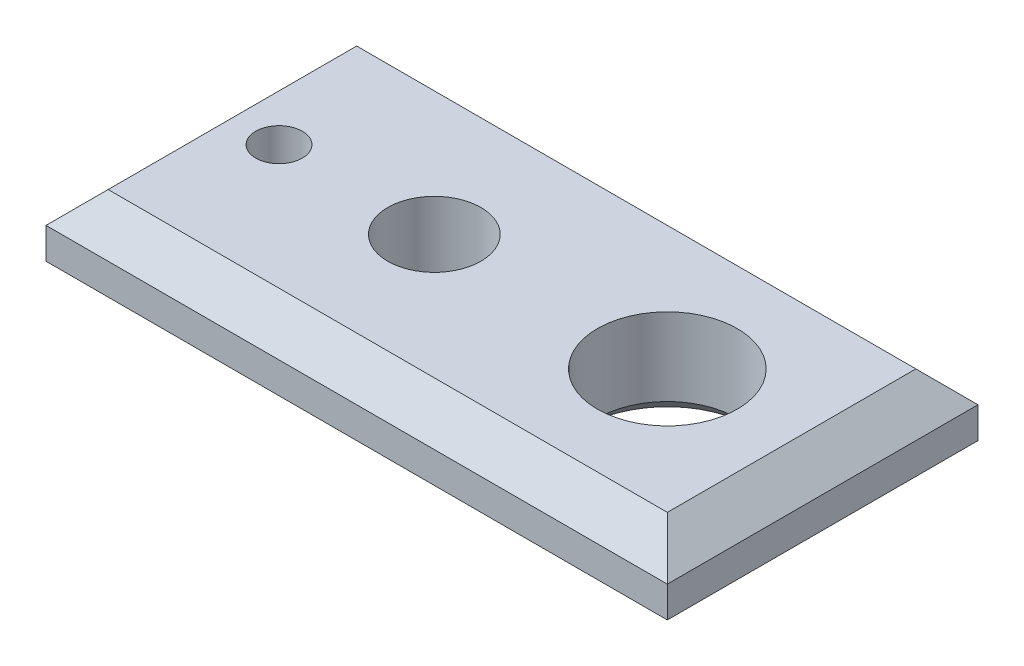
ISO-10303-21;
HEADER;
FILE_DESCRIPTION(('STEP AP214'),'2;1');
FILE_NAME('part.step','',(''),(''),'','','');
FILE_SCHEMA(('AUTOMOTIVE_DESIGN { 1 0 10303 214 1 1 1 1 }'));
ENDSEC;
DATA;
#1=APPLICATION_CONTEXT('core data for automotive mechanical design processes');
#2=APPLICATION_PROTOCOL_DEFINITION('international standard','automotive_design',2000,#1);
#3=PRODUCT_CONTEXT('',#1,'mechanical');
#4=PRODUCT('Part','Part','',(#3));
#5=PRODUCT_RELATED_PRODUCT_CATEGORY('part','',(#4));
#6=PRODUCT_DEFINITION_FORMATION('','',#4);
#7=PRODUCT_DEFINITION_CONTEXT('part definition',#1,'design');
#8=PRODUCT_DEFINITION('design','',#6,#7);
#9=PRODUCT_DEFINITION_SHAPE('','',#8);
#10=(LENGTH_UNIT() NAMED_UNIT(*) SI_UNIT(.MILLI.,.METRE.));
#11=(NAMED_UNIT(*) PLANE_ANGLE_UNIT() SI_UNIT($,.RADIAN.));
#12=(NAMED_UNIT(*) SI_UNIT($,.STERADIAN.) SOLID_ANGLE_UNIT());
#13=UNCERTAINTY_MEASURE_WITH_UNIT(LENGTH_MEASURE(1.E-05),#10,'distance_accuracy_value','');
#14=(GEOMETRIC_REPRESENTATION_CONTEXT(3) GLOBAL_UNCERTAINTY_ASSIGNED_CONTEXT((#13)) GLOBAL_UNIT_ASSIGNED_CONTEXT((#10,
#11,#12)) REPRESENTATION_CONTEXT('',''));
#15=CARTESIAN_POINT('',(0.,0.,0.));
#16=DIRECTION('',(0.,0.,1.));
#17=DIRECTION('',(1.,0.,0.));
#18=AXIS2_PLACEMENT_3D('',#15,#16,#17);
#19=CARTESIAN_POINT('',(0.,30.,0.));
#20=DIRECTION('',(0.,1.,0.));
#21=DIRECTION('',(0.,0.,1.));
#22=AXIS2_PLACEMENT_3D('',#19,#20,#21);
#23=PLANE('',#22);
#24=DIRECTION('',(0.,0.,-1.));
#25=VECTOR('',#24,1.);
#26=CARTESIAN_POINT('',(90.,30.,-50.));
#27=LINE('',#26,#25);
#28=CARTESIAN_POINT('',(90.,30.,40.));
#29=VERTEX_POINT('',#28);
#30=CARTESIAN_POINT('',(90.,30.,-40.));
#31=VERTEX_POINT('',#30);
#32=EDGE_CURVE('E114',#29,#31,#27,.T.);
#33=ORIENTED_EDGE('',*,*,#32,.T.);
#34=DIRECTION('',(-1.,0.,0.));
#35=VECTOR('',#34,1.);
#36=CARTESIAN_POINT('',(-100.,30.,-40.));
#37=LINE('',#36,#35);
#38=CARTESIAN_POINT('',(-90.,30.,-40.));
#39=VERTEX_POINT('',#38);
#40=EDGE_CURVE('E147',#31,#39,#37,.T.);
#41=ORIENTED_EDGE('',*,*,#40,.T.);
#42=DIRECTION('',(0.,0.,1.));
#43=VECTOR('',#42,1.);
#44=CARTESIAN_POINT('',(-90.,30.,50.));
#45=LINE('',#44,#43);
#46=CARTESIAN_POINT('',(-90.,30.,40.));
#47=VERTEX_POINT('',#46);
#48=EDGE_CURVE('E117',#39,#47,#45,.T.);
#49=ORIENTED_EDGE('',*,*,#48,.T.);
#50=DIRECTION('',(1.,0.,0.));
#51=VECTOR('',#50,1.);
#52=CARTESIAN_POINT('',(100.,30.,40.));
#53=LINE('',#52,#51);
#54=EDGE_CURVE('E109',#47,#29,#53,.T.);
#55=ORIENTED_EDGE('',*,*,#54,.T.);
#56=EDGE_LOOP('',(#33,#41,#49,#55));
#57=FACE_BOUND('',#56,.T.);
#58=CARTESIAN_POINT('',(-75.,30.,0.));
#59=DIRECTION('',(0.,1.,0.));
#60=DIRECTION('',(0.,0.,1.));
#61=AXIS2_PLACEMENT_3D('',#58,#59,#60);
#62=CIRCLE('',#61,7.50000000000001);
#63=CARTESIAN_POINT('',(-75.,30.,7.50000000000001));
#64=VERTEX_POINT('',#63);
#65=EDGE_CURVE('E263',#64,#64,#62,.T.);
#66=ORIENTED_EDGE('',*,*,#65,.F.);
#67=EDGE_LOOP('',(#66));
#68=FACE_BOUND('',#67,.T.);
#69=CARTESIAN_POINT('',(-25.,30.,0.));
#70=DIRECTION('',(0.,1.,0.));
#71=DIRECTION('',(0.,0.,1.));
#72=AXIS2_PLACEMENT_3D('',#69,#70,#71);
#73=CIRCLE('',#72,15.);
#74=CARTESIAN_POINT('',(-25.,30.,15.));
#75=VERTEX_POINT('',#74);
#76=EDGE_CURVE('E259',#75,#75,#73,.T.);
#77=ORIENTED_EDGE('',*,*,#76,.F.);
#78=EDGE_LOOP('',(#77));
#79=FACE_BOUND('',#78,.T.);
#80=CARTESIAN_POINT('',(50.,30.,0.));
#81=DIRECTION('',(0.,1.,0.));
#82=DIRECTION('',(0.,0.,1.));
#83=AXIS2_PLACEMENT_3D('',#80,#81,#82);
#84=CIRCLE('',#83,22.5);
#85=CARTESIAN_POINT('',(50.,30.,22.5));
#86=VERTEX_POINT('',#85);
#87=EDGE_CURVE('E131',#86,#86,#84,.T.);
#88=ORIENTED_EDGE('',*,*,#87,.F.);
#89=EDGE_LOOP('',(#88));
#90=FACE_BOUND('',#89,.T.);
#91=ADVANCED_FACE('F41',(#57,#68,#79,#90),#23,.T.);
#92=CARTESIAN_POINT('',(0.,0.,0.));
#93=DIRECTION('',(0.,1.,0.));
#94=DIRECTION('',(0.,0.,1.));
#95=AXIS2_PLACEMENT_3D('',#92,#93,#94);
#96=PLANE('',#95);
#97=DIRECTION('',(-1.,0.,0.));
#98=VECTOR('',#97,1.);
#99=CARTESIAN_POINT('',(0.,0.,40.));
#100=LINE('',#99,#98);
#101=CARTESIAN_POINT('',(90.,0.,40.));
#102=VERTEX_POINT('',#101);
#103=CARTESIAN_POINT('',(-90.,0.,40.));
#104=VERTEX_POINT('',#103);
#105=EDGE_CURVE('E197',#102,#104,#100,.T.);
#106=ORIENTED_EDGE('',*,*,#105,.T.);
#107=DIRECTION('',(0.,0.,-1.));
#108=VECTOR('',#107,1.);
#109=CARTESIAN_POINT('',(-90.,0.,0.));
#110=LINE('',#109,#108);
#111=CARTESIAN_POINT('',(-90.,0.,-40.));
#112=VERTEX_POINT('',#111);
#113=EDGE_CURVE('E206',#104,#112,#110,.T.);
#114=ORIENTED_EDGE('',*,*,#113,.T.);
#115=DIRECTION('',(1.,0.,0.));
#116=VECTOR('',#115,1.);
#117=CARTESIAN_POINT('',(0.,0.,-40.));
#118=LINE('',#117,#116);
#119=CARTESIAN_POINT('',(90.,0.,-40.));
#120=VERTEX_POINT('',#119);
#121=EDGE_CURVE('E203',#112,#120,#118,.T.);
#122=ORIENTED_EDGE('',*,*,#121,.T.);
#123=DIRECTION('',(0.,0.,1.));
#124=VECTOR('',#123,1.);
#125=CARTESIAN_POINT('',(90.,0.,0.));
#126=LINE('',#125,#124);
#127=EDGE_CURVE('E200',#120,#102,#126,.T.);
#128=ORIENTED_EDGE('',*,*,#127,.T.);
#129=EDGE_LOOP('',(#106,#114,#122,#128));
#130=FACE_BOUND('',#129,.T.);
#131=CARTESIAN_POINT('',(50.,0.,0.));
#132=DIRECTION('',(0.,1.,0.));
#133=DIRECTION('',(0.,0.,1.));
#134=AXIS2_PLACEMENT_3D('',#131,#132,#133);
#135=CIRCLE('',#134,27.5);
#136=CARTESIAN_POINT('',(50.,0.,27.5));
#137=VERTEX_POINT('',#136);
#138=EDGE_CURVE('E177',#137,#137,#135,.T.);
#139=ORIENTED_EDGE('',*,*,#138,.T.);
#140=EDGE_LOOP('',(#139));
#141=FACE_BOUND('',#140,.T.);
#142=CARTESIAN_POINT('',(-25.,0.,0.));
#143=DIRECTION('',(0.,1.,0.));
#144=DIRECTION('',(0.,0.,1.));
#145=AXIS2_PLACEMENT_3D('',#142,#143,#144);
#146=CIRCLE('',#145,20.);
#147=CARTESIAN_POINT('',(-25.,0.,20.));
#148=VERTEX_POINT('',#147);
#149=EDGE_CURVE('E173',#148,#148,#146,.T.);
#150=ORIENTED_EDGE('',*,*,#149,.T.);
#151=EDGE_LOOP('',(#150));
#152=FACE_BOUND('',#151,.T.);
#153=CARTESIAN_POINT('',(-75.,0.,0.));
#154=DIRECTION('',(0.,1.,0.));
#155=DIRECTION('',(0.,0.,1.));
#156=AXIS2_PLACEMENT_3D('',#153,#154,#155);
#157=CIRCLE('',#156,12.5);
#158=CARTESIAN_POINT('',(-75.,0.,12.5));
#159=VERTEX_POINT('',#158);
#160=EDGE_CURVE('E162',#159,#159,#157,.T.);
#161=ORIENTED_EDGE('',*,*,#160,.T.);
#162=EDGE_LOOP('',(#161));
#163=FACE_BOUND('',#162,.T.);
#164=ADVANCED_FACE('F237',(#130,#141,#152,#163),#96,.F.);
#165=CARTESIAN_POINT('',(-100.,30.,50.));
#166=DIRECTION('',(1.,0.,0.));
#167=DIRECTION('',(0.,0.,-1.));
#168=AXIS2_PLACEMENT_3D('',#165,#166,#167);
#169=PLANE('',#168);
#170=DIRECTION('',(0.,-1.,0.));
#171=VECTOR('',#170,1.);
#172=CARTESIAN_POINT('',(-100.,30.,-50.));
#173=LINE('',#172,#171);
#174=CARTESIAN_POINT('',(-100.,19.9999999999999,-50.));
#175=VERTEX_POINT('',#174);
#176=CARTESIAN_POINT('',(-100.,9.99999999999998,-50.));
#177=VERTEX_POINT('',#176);
#178=EDGE_CURVE('E250',#175,#177,#173,.T.);
#179=ORIENTED_EDGE('',*,*,#178,.T.);
#180=DIRECTION('',(0.,0.,1.));
#181=VECTOR('',#180,1.);
#182=CARTESIAN_POINT('',(-100.,9.99999999999998,50.));
#183=LINE('',#182,#181);
#184=CARTESIAN_POINT('',(-100.,9.99999999999998,50.));
#185=VERTEX_POINT('',#184);
#186=EDGE_CURVE('E193',#177,#185,#183,.T.);
#187=ORIENTED_EDGE('',*,*,#186,.T.);
#188=DIRECTION('',(0.,-1.,0.));
#189=VECTOR('',#188,1.);
#190=CARTESIAN_POINT('',(-100.,30.,50.));
#191=LINE('',#190,#189);
#192=CARTESIAN_POINT('',(-100.,19.9999999999999,50.));
#193=VERTEX_POINT('',#192);
#194=EDGE_CURVE('E138',#193,#185,#191,.T.);
#195=ORIENTED_EDGE('',*,*,#194,.F.);
#196=DIRECTION('',(0.,0.,-1.));
#197=VECTOR('',#196,1.);
#198=CARTESIAN_POINT('',(-100.,19.9999999999999,-50.));
#199=LINE('',#198,#197);
#200=EDGE_CURVE('E154',#193,#175,#199,.T.);
#201=ORIENTED_EDGE('',*,*,#200,.T.);
#202=EDGE_LOOP('',(#179,#187,#195,#201));
#203=FACE_BOUND('',#202,.T.);
#204=ADVANCED_FACE('F248',(#203),#169,.F.);
#205=CARTESIAN_POINT('',(100.,30.,50.));
#206=DIRECTION('',(0.,0.,-1.));
#207=DIRECTION('',(-1.,0.,0.));
#208=AXIS2_PLACEMENT_3D('',#205,#206,#207);
#209=PLANE('',#208);
#210=ORIENTED_EDGE('',*,*,#194,.T.);
#211=DIRECTION('',(1.,0.,0.));
#212=VECTOR('',#211,1.);
#213=CARTESIAN_POINT('',(100.,9.99999999999998,50.));
#214=LINE('',#213,#212);
#215=CARTESIAN_POINT('',(100.,9.99999999999998,50.));
#216=VERTEX_POINT('',#215);
#217=EDGE_CURVE('E11',#185,#216,#214,.T.);
#218=ORIENTED_EDGE('',*,*,#217,.T.);
#219=DIRECTION('',(0.,-1.,0.));
#220=VECTOR('',#219,1.);
#221=CARTESIAN_POINT('',(100.,30.,50.));
#222=LINE('',#221,#220);
#223=CARTESIAN_POINT('',(100.,19.9999999999999,50.));
#224=VERTEX_POINT('',#223);
#225=EDGE_CURVE('E141',#224,#216,#222,.T.);
#226=ORIENTED_EDGE('',*,*,#225,.F.);
#227=DIRECTION('',(-1.,0.,0.));
#228=VECTOR('',#227,1.);
#229=CARTESIAN_POINT('',(-100.,19.9999999999999,50.));
#230=LINE('',#229,#228);
#231=EDGE_CURVE('E127',#224,#193,#230,.T.);
#232=ORIENTED_EDGE('',*,*,#231,.T.);
#233=EDGE_LOOP('',(#210,#218,#226,#232));
#234=FACE_BOUND('',#233,.T.);
#235=ADVANCED_FACE('F251',(#234),#209,.F.);
#236=CARTESIAN_POINT('',(100.,30.,50.));
#237=DIRECTION('',(-1.,0.,0.));
#238=DIRECTION('',(0.,0.,1.));
#239=AXIS2_PLACEMENT_3D('',#236,#237,#238);
#240=PLANE('',#239);
#241=ORIENTED_EDGE('',*,*,#225,.T.);
#242=DIRECTION('',(0.,0.,-1.));
#243=VECTOR('',#242,1.);
#244=CARTESIAN_POINT('',(100.,9.99999999999998,50.));
#245=LINE('',#244,#243);
#246=CARTESIAN_POINT('',(100.,9.99999999999998,-50.));
#247=VERTEX_POINT('',#246);
#248=EDGE_CURVE('E52',#216,#247,#245,.T.);
#249=ORIENTED_EDGE('',*,*,#248,.T.);
#250=DIRECTION('',(0.,-1.,0.));
#251=VECTOR('',#250,1.);
#252=CARTESIAN_POINT('',(100.,30.,-50.));
#253=LINE('',#252,#251);
#254=CARTESIAN_POINT('',(100.,19.9999999999999,-50.));
#255=VERTEX_POINT('',#254);
#256=EDGE_CURVE('E253',#255,#247,#253,.T.);
#257=ORIENTED_EDGE('',*,*,#256,.F.);
#258=DIRECTION('',(0.,0.,1.));
#259=VECTOR('',#258,1.);
#260=CARTESIAN_POINT('',(100.,19.9999999999999,50.));
#261=LINE('',#260,#259);
#262=EDGE_CURVE('E159',#255,#224,#261,.T.);
#263=ORIENTED_EDGE('',*,*,#262,.T.);
#264=EDGE_LOOP('',(#241,#249,#257,#263));
#265=FACE_BOUND('',#264,.T.);
#266=ADVANCED_FACE('F286',(#265),#240,.F.);
#267=CARTESIAN_POINT('',(100.,30.,-50.));
#268=DIRECTION('',(0.,0.,1.));
#269=DIRECTION('',(1.,0.,0.));
#270=AXIS2_PLACEMENT_3D('',#267,#268,#269);
#271=PLANE('',#270);
#272=ORIENTED_EDGE('',*,*,#256,.T.);
#273=DIRECTION('',(-1.,0.,0.));
#274=VECTOR('',#273,1.);
#275=CARTESIAN_POINT('',(100.,9.99999999999998,-50.));
#276=LINE('',#275,#274);
#277=EDGE_CURVE('E210',#247,#177,#276,.T.);
#278=ORIENTED_EDGE('',*,*,#277,.T.);
#279=ORIENTED_EDGE('',*,*,#178,.F.);
#280=DIRECTION('',(1.,0.,0.));
#281=VECTOR('',#280,1.);
#282=CARTESIAN_POINT('',(100.,19.9999999999999,-50.));
#283=LINE('',#282,#281);
#284=EDGE_CURVE('E150',#175,#255,#283,.T.);
#285=ORIENTED_EDGE('',*,*,#284,.T.);
#286=EDGE_LOOP('',(#272,#278,#279,#285));
#287=FACE_BOUND('',#286,.T.);
#288=ADVANCED_FACE('F283',(#287),#271,.F.);
#289=CARTESIAN_POINT('',(-25.,30.,0.));
#290=DIRECTION('',(0.,-1.,0.));
#291=DIRECTION('',(0.,0.,-1.));
#292=AXIS2_PLACEMENT_3D('',#289,#290,#291);
#293=CYLINDRICAL_SURFACE('',#292,15.);
#294=CARTESIAN_POINT('',(-25.,5.00000000000002,0.));
#295=DIRECTION('',(0.,1.,0.));
#296=DIRECTION('',(0.,0.,1.));
#297=AXIS2_PLACEMENT_3D('',#294,#295,#296);
#298=CIRCLE('',#297,15.);
#299=CARTESIAN_POINT('',(-25.,5.00000000000002,15.));
#300=VERTEX_POINT('',#299);
#301=EDGE_CURVE('E185',#300,#300,#298,.F.);
#302=ORIENTED_EDGE('',*,*,#301,.T.);
#303=EDGE_LOOP('',(#302));
#304=FACE_BOUND('',#303,.T.);
#305=ORIENTED_EDGE('',*,*,#76,.T.);
#306=EDGE_LOOP('',(#305));
#307=FACE_BOUND('',#306,.T.);
#308=ADVANCED_FACE('F280',(#304,#307),#293,.F.);
#309=CARTESIAN_POINT('',(-75.,30.,0.));
#310=DIRECTION('',(0.,-1.,0.));
#311=DIRECTION('',(0.,0.,-1.));
#312=AXIS2_PLACEMENT_3D('',#309,#310,#311);
#313=CYLINDRICAL_SURFACE('',#312,7.50000000000001);
#314=CARTESIAN_POINT('',(-75.,5.00000000000003,0.));
#315=DIRECTION('',(0.,1.,0.));
#316=DIRECTION('',(0.,0.,1.));
#317=AXIS2_PLACEMENT_3D('',#314,#315,#316);
#318=CIRCLE('',#317,7.50000000000001);
#319=CARTESIAN_POINT('',(-75.,5.00000000000003,7.50000000000001));
#320=VERTEX_POINT('',#319);
#321=EDGE_CURVE('E189',#320,#320,#318,.F.);
#322=ORIENTED_EDGE('',*,*,#321,.T.);
#323=EDGE_LOOP('',(#322));
#324=FACE_BOUND('',#323,.T.);
#325=ORIENTED_EDGE('',*,*,#65,.T.);
#326=EDGE_LOOP('',(#325));
#327=FACE_BOUND('',#326,.T.);
#328=ADVANCED_FACE('F394',(#324,#327),#313,.F.);
#329=CARTESIAN_POINT('',(50.,30.,0.));
#330=DIRECTION('',(0.,-1.,0.));
#331=DIRECTION('',(0.,0.,-1.));
#332=AXIS2_PLACEMENT_3D('',#329,#330,#331);
#333=CYLINDRICAL_SURFACE('',#332,22.5);
#334=CARTESIAN_POINT('',(50.,5.,0.));
#335=DIRECTION('',(0.,1.,0.));
#336=DIRECTION('',(0.,0.,1.));
#337=AXIS2_PLACEMENT_3D('',#334,#335,#336);
#338=CIRCLE('',#337,22.5);
#339=CARTESIAN_POINT('',(50.,5.,22.5));
#340=VERTEX_POINT('',#339);
#341=EDGE_CURVE('E181',#340,#340,#338,.F.);
#342=ORIENTED_EDGE('',*,*,#341,.T.);
#343=EDGE_LOOP('',(#342));
#344=FACE_BOUND('',#343,.T.);
#345=ORIENTED_EDGE('',*,*,#87,.T.);
#346=EDGE_LOOP('',(#345));
#347=FACE_BOUND('',#346,.T.);
#348=ADVANCED_FACE('F271',(#344,#347),#333,.F.);
#349=CARTESIAN_POINT('',(0.,30.,40.));
#350=DIRECTION('',(0.,0.707106781186545,0.707106781186549));
#351=DIRECTION('',(-1.,0.,0.));
#352=AXIS2_PLACEMENT_3D('',#349,#350,#351);
#353=PLANE('',#352);
#354=DIRECTION('',(-0.577350269189625,-0.577350269189628,0.577350269189625));
#355=VECTOR('',#354,1.);
#356=CARTESIAN_POINT('',(-60.0000000000001,60.,10.0000000000001));
#357=LINE('',#356,#355);
#358=EDGE_CURVE('E132',#193,#47,#357,.F.);
#359=ORIENTED_EDGE('',*,*,#358,.F.);
#360=ORIENTED_EDGE('',*,*,#231,.F.);
#361=DIRECTION('',(0.577350269189625,-0.577350269189628,0.577350269189625));
#362=VECTOR('',#361,1.);
#363=CARTESIAN_POINT('',(76.6666666666667,43.3333333333333,26.6666666666667));
#364=LINE('',#363,#362);
#365=EDGE_CURVE('E125',#29,#224,#364,.T.);
#366=ORIENTED_EDGE('',*,*,#365,.F.);
#367=ORIENTED_EDGE('',*,*,#54,.F.);
#368=EDGE_LOOP('',(#359,#360,#366,#367));
#369=FACE_BOUND('',#368,.T.);
#370=ADVANCED_FACE('F126',(#369),#353,.T.);
#371=CARTESIAN_POINT('',(90.,30.,0.));
#372=DIRECTION('',(0.707106781186549,0.707106781186545,0.));
#373=DIRECTION('',(0.,0.,1.));
#374=AXIS2_PLACEMENT_3D('',#371,#372,#373);
#375=PLANE('',#374);
#376=ORIENTED_EDGE('',*,*,#365,.T.);
#377=ORIENTED_EDGE('',*,*,#262,.F.);
#378=DIRECTION('',(-0.577350269189625,0.577350269189628,0.577350269189625));
#379=VECTOR('',#378,1.);
#380=CARTESIAN_POINT('',(76.6666666666667,43.3333333333334,-26.6666666666667));
#381=LINE('',#380,#379);
#382=EDGE_CURVE('E135',#31,#255,#381,.F.);
#383=ORIENTED_EDGE('',*,*,#382,.F.);
#384=ORIENTED_EDGE('',*,*,#32,.F.);
#385=EDGE_LOOP('',(#376,#377,#383,#384));
#386=FACE_BOUND('',#385,.T.);
#387=ADVANCED_FACE('F134',(#386),#375,.T.);
#388=CARTESIAN_POINT('',(-90.,30.,0.));
#389=DIRECTION('',(-0.707106781186549,0.707106781186545,0.));
#390=DIRECTION('',(0.,0.,-1.));
#391=AXIS2_PLACEMENT_3D('',#388,#389,#390);
#392=PLANE('',#391);
#393=ORIENTED_EDGE('',*,*,#358,.T.);
#394=ORIENTED_EDGE('',*,*,#48,.F.);
#395=DIRECTION('',(-0.577350269189625,-0.577350269189628,-0.577350269189625));
#396=VECTOR('',#395,1.);
#397=CARTESIAN_POINT('',(-76.6666666666667,43.3333333333333,-26.6666666666667));
#398=LINE('',#397,#396);
#399=EDGE_CURVE('E163',#175,#39,#398,.F.);
#400=ORIENTED_EDGE('',*,*,#399,.F.);
#401=ORIENTED_EDGE('',*,*,#200,.F.);
#402=EDGE_LOOP('',(#393,#394,#400,#401));
#403=FACE_BOUND('',#402,.T.);
#404=ADVANCED_FACE('F303',(#403),#392,.T.);
#405=CARTESIAN_POINT('',(0.,30.,-40.));
#406=DIRECTION('',(0.,0.707106781186545,-0.707106781186549));
#407=DIRECTION('',(1.,0.,0.));
#408=AXIS2_PLACEMENT_3D('',#405,#406,#407);
#409=PLANE('',#408);
#410=ORIENTED_EDGE('',*,*,#382,.T.);
#411=ORIENTED_EDGE('',*,*,#284,.F.);
#412=ORIENTED_EDGE('',*,*,#399,.T.);
#413=ORIENTED_EDGE('',*,*,#40,.F.);
#414=EDGE_LOOP('',(#410,#411,#412,#413));
#415=FACE_BOUND('',#414,.T.);
#416=ADVANCED_FACE('F295',(#415),#409,.T.);
#417=CARTESIAN_POINT('',(50.,0.,0.));
#418=DIRECTION('',(0.,-1.,0.));
#419=DIRECTION('',(0.,0.,-1.));
#420=AXIS2_PLACEMENT_3D('',#417,#418,#419);
#421=CONICAL_SURFACE('',#420,27.5,0.785398163397448);
#422=ORIENTED_EDGE('',*,*,#341,.F.);
#423=EDGE_LOOP('',(#422));
#424=FACE_BOUND('',#423,.T.);
#425=ORIENTED_EDGE('',*,*,#138,.F.);
#426=EDGE_LOOP('',(#425));
#427=FACE_BOUND('',#426,.T.);
#428=ADVANCED_FACE('F302',(#424,#427),#421,.F.);
#429=CARTESIAN_POINT('',(-25.,0.,0.));
#430=DIRECTION('',(0.,-1.,0.));
#431=DIRECTION('',(0.,0.,-1.));
#432=AXIS2_PLACEMENT_3D('',#429,#430,#431);
#433=CONICAL_SURFACE('',#432,20.,0.785398163397448);
#434=ORIENTED_EDGE('',*,*,#301,.F.);
#435=EDGE_LOOP('',(#434));
#436=FACE_BOUND('',#435,.T.);
#437=ORIENTED_EDGE('',*,*,#149,.F.);
#438=EDGE_LOOP('',(#437));
#439=FACE_BOUND('',#438,.T.);
#440=ADVANCED_FACE('F325',(#436,#439),#433,.F.);
#441=CARTESIAN_POINT('',(-75.,0.,0.));
#442=DIRECTION('',(0.,-1.,0.));
#443=DIRECTION('',(0.,0.,-1.));
#444=AXIS2_PLACEMENT_3D('',#441,#442,#443);
#445=CONICAL_SURFACE('',#444,12.5,0.785398163397448);
#446=ORIENTED_EDGE('',*,*,#321,.F.);
#447=EDGE_LOOP('',(#446));
#448=FACE_BOUND('',#447,.T.);
#449=ORIENTED_EDGE('',*,*,#160,.F.);
#450=EDGE_LOOP('',(#449));
#451=FACE_BOUND('',#450,.T.);
#452=ADVANCED_FACE('F332',(#448,#451),#445,.F.);
#453=CARTESIAN_POINT('',(100.,9.99999999999998,50.));
#454=DIRECTION('',(-0.707106781186546,0.707106781186548,0.));
#455=DIRECTION('',(0.,0.,-1.));
#456=AXIS2_PLACEMENT_3D('',#453,#454,#455);
#457=PLANE('',#456);
#458=DIRECTION('',(0.577350269189626,0.577350269189625,0.577350269189626));
#459=VECTOR('',#458,1.);
#460=CARTESIAN_POINT('',(100.,9.99999999999998,50.));
#461=LINE('',#460,#459);
#462=EDGE_CURVE('E220',#102,#216,#461,.T.);
#463=ORIENTED_EDGE('',*,*,#462,.F.);
#464=ORIENTED_EDGE('',*,*,#127,.F.);
#465=DIRECTION('',(0.577350269189626,0.577350269189625,-0.577350269189626));
#466=VECTOR('',#465,1.);
#467=CARTESIAN_POINT('',(66.6666666666666,-23.3333333333333,-16.6666666666666));
#468=LINE('',#467,#466);
#469=EDGE_CURVE('E46',#247,#120,#468,.F.);
#470=ORIENTED_EDGE('',*,*,#469,.F.);
#471=ORIENTED_EDGE('',*,*,#248,.F.);
#472=EDGE_LOOP('',(#463,#464,#470,#471));
#473=FACE_BOUND('',#472,.T.);
#474=ADVANCED_FACE('F44',(#473),#457,.F.);
#475=CARTESIAN_POINT('',(100.,9.99999999999998,-50.));
#476=DIRECTION('',(0.,0.707106781186548,0.707106781186546));
#477=DIRECTION('',(-1.,0.,0.));
#478=AXIS2_PLACEMENT_3D('',#475,#476,#477);
#479=PLANE('',#478);
#480=ORIENTED_EDGE('',*,*,#469,.T.);
#481=ORIENTED_EDGE('',*,*,#121,.F.);
#482=DIRECTION('',(-0.577350269189626,0.577350269189625,-0.577350269189626));
#483=VECTOR('',#482,1.);
#484=CARTESIAN_POINT('',(-33.3333333333332,-56.6666666666666,16.6666666666668));
#485=LINE('',#484,#483);
#486=EDGE_CURVE('E218',#177,#112,#485,.F.);
#487=ORIENTED_EDGE('',*,*,#486,.F.);
#488=ORIENTED_EDGE('',*,*,#277,.F.);
#489=EDGE_LOOP('',(#480,#481,#487,#488));
#490=FACE_BOUND('',#489,.T.);
#491=ADVANCED_FACE('F232',(#490),#479,.F.);
#492=CARTESIAN_POINT('',(100.,9.99999999999998,50.));
#493=DIRECTION('',(0.,0.707106781186548,-0.707106781186546));
#494=DIRECTION('',(1.,0.,0.));
#495=AXIS2_PLACEMENT_3D('',#492,#493,#494);
#496=PLANE('',#495);
#497=ORIENTED_EDGE('',*,*,#462,.T.);
#498=ORIENTED_EDGE('',*,*,#217,.F.);
#499=DIRECTION('',(0.577350269189626,-0.577350269189625,-0.577350269189626));
#500=VECTOR('',#499,1.);
#501=CARTESIAN_POINT('',(-33.3333333333332,-56.6666666666666,-16.6666666666668));
#502=LINE('',#501,#500);
#503=EDGE_CURVE('E215',#104,#185,#502,.F.);
#504=ORIENTED_EDGE('',*,*,#503,.F.);
#505=ORIENTED_EDGE('',*,*,#105,.F.);
#506=EDGE_LOOP('',(#497,#498,#504,#505));
#507=FACE_BOUND('',#506,.T.);
#508=ADVANCED_FACE('F244',(#507),#496,.F.);
#509=CARTESIAN_POINT('',(-100.,9.99999999999998,50.));
#510=DIRECTION('',(0.707106781186546,0.707106781186548,0.));
#511=DIRECTION('',(0.,0.,1.));
#512=AXIS2_PLACEMENT_3D('',#509,#510,#511);
#513=PLANE('',#512);
#514=ORIENTED_EDGE('',*,*,#486,.T.);
#515=ORIENTED_EDGE('',*,*,#113,.F.);
#516=ORIENTED_EDGE('',*,*,#503,.T.);
#517=ORIENTED_EDGE('',*,*,#186,.F.);
#518=EDGE_LOOP('',(#514,#515,#516,#517));
#519=FACE_BOUND('',#518,.T.);
#520=ADVANCED_FACE('F242',(#519),#513,.F.);
#521=CLOSED_SHELL('',(#91,#164,#204,#235,#266,#288,#308,#328,#348,#370,#387,#404,#416,#428,#440,
#452,#474,#491,#508,#520));
#522=MANIFOLD_SOLID_BREP('B2',#521);
#523=ADVANCED_BREP_SHAPE_REPRESENTATION('',(#18,#522),#14);
#524=SHAPE_DEFINITION_REPRESENTATION(#9,#523);
ENDSEC;
END-ISO-10303-21;
